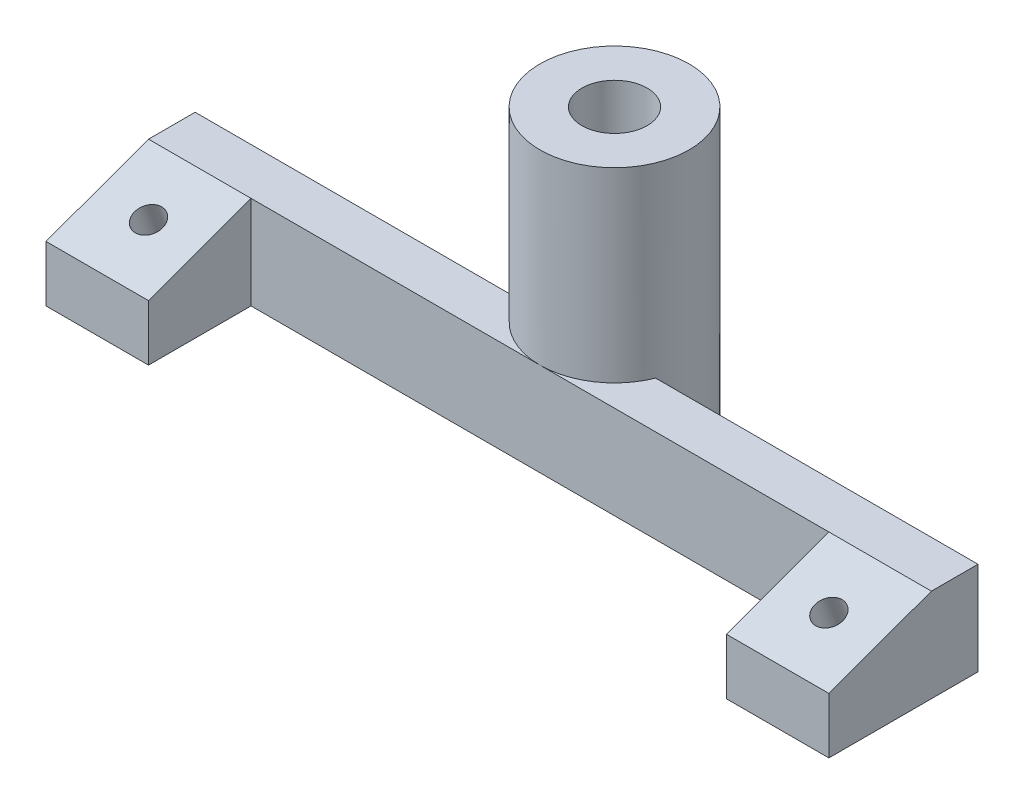
ISO-10303-21;
HEADER;
FILE_DESCRIPTION(('STEP AP214'),'2;1');
FILE_NAME('part.step','',(''),(''),'','','');
FILE_SCHEMA(('AUTOMOTIVE_DESIGN { 1 0 10303 214 1 1 1 1 }'));
ENDSEC;
DATA;
#1=APPLICATION_CONTEXT('core data for automotive mechanical design processes');
#2=APPLICATION_PROTOCOL_DEFINITION('international standard','automotive_design',2000,#1);
#3=PRODUCT_CONTEXT('',#1,'mechanical');
#4=PRODUCT('Part','Part','',(#3));
#5=PRODUCT_RELATED_PRODUCT_CATEGORY('part','',(#4));
#6=PRODUCT_DEFINITION_FORMATION('','',#4);
#7=PRODUCT_DEFINITION_CONTEXT('part definition',#1,'design');
#8=PRODUCT_DEFINITION('design','',#6,#7);
#9=PRODUCT_DEFINITION_SHAPE('','',#8);
#10=(LENGTH_UNIT() NAMED_UNIT(*) SI_UNIT(.MILLI.,.METRE.));
#11=(NAMED_UNIT(*) PLANE_ANGLE_UNIT() SI_UNIT($,.RADIAN.));
#12=(NAMED_UNIT(*) SI_UNIT($,.STERADIAN.) SOLID_ANGLE_UNIT());
#13=UNCERTAINTY_MEASURE_WITH_UNIT(LENGTH_MEASURE(1.E-05),#10,'distance_accuracy_value','');
#14=(GEOMETRIC_REPRESENTATION_CONTEXT(3) GLOBAL_UNCERTAINTY_ASSIGNED_CONTEXT((#13)) GLOBAL_UNIT_ASSIGNED_CONTEXT((#10,
#11,#12)) REPRESENTATION_CONTEXT('',''));
#15=CARTESIAN_POINT('',(0.,0.,0.));
#16=DIRECTION('',(0.,0.,1.));
#17=DIRECTION('',(1.,0.,0.));
#18=AXIS2_PLACEMENT_3D('',#15,#16,#17);
#19=CARTESIAN_POINT('',(0.,0.,-13.5));
#20=DIRECTION('',(0.,1.,0.));
#21=DIRECTION('',(0.,0.,1.));
#22=AXIS2_PLACEMENT_3D('',#19,#20,#21);
#23=CYLINDRICAL_SURFACE('',#22,3.5);
#24=CARTESIAN_POINT('',(0.,30.,-13.5));
#25=DIRECTION('',(0.,1.,0.));
#26=DIRECTION('',(0.,0.,1.));
#27=AXIS2_PLACEMENT_3D('',#24,#25,#26);
#28=CIRCLE('',#27,3.5);
#29=CARTESIAN_POINT('',(0.,30.,-10.));
#30=VERTEX_POINT('',#29);
#31=EDGE_CURVE('E145',#30,#30,#28,.T.);
#32=ORIENTED_EDGE('',*,*,#31,.T.);
#33=EDGE_LOOP('',(#32));
#34=FACE_BOUND('',#33,.T.);
#35=CARTESIAN_POINT('',(0.,24.,-13.5));
#36=DIRECTION('',(0.,-1.,0.));
#37=DIRECTION('',(0.,0.,-1.));
#38=AXIS2_PLACEMENT_3D('',#35,#36,#37);
#39=CIRCLE('',#38,3.5);
#40=CARTESIAN_POINT('',(0.,24.,-17.));
#41=VERTEX_POINT('',#40);
#42=EDGE_CURVE('E41',#41,#41,#39,.F.);
#43=ORIENTED_EDGE('',*,*,#42,.F.);
#44=EDGE_LOOP('',(#43));
#45=FACE_BOUND('',#44,.T.);
#46=ADVANCED_FACE('F37',(#34,#45),#23,.F.);
#47=CARTESIAN_POINT('',(-42.,10.,-10.5));
#48=DIRECTION('',(0.,0.,1.));
#49=DIRECTION('',(1.,0.,0.));
#50=AXIS2_PLACEMENT_3D('',#47,#48,#49);
#51=PLANE('',#50);
#52=DIRECTION('',(-1.,0.,0.));
#53=VECTOR('',#52,1.);
#54=CARTESIAN_POINT('',(-42.,10.,-10.5));
#55=LINE('',#54,#53);
#56=CARTESIAN_POINT('',(-7.41619848709566,10.,-10.5));
#57=VERTEX_POINT('',#56);
#58=CARTESIAN_POINT('',(-42.,10.,-10.5));
#59=VERTEX_POINT('',#58);
#60=EDGE_CURVE('E228',#57,#59,#55,.T.);
#61=ORIENTED_EDGE('',*,*,#60,.F.);
#62=DIRECTION('',(0.,-1.,0.));
#63=VECTOR('',#62,1.);
#64=CARTESIAN_POINT('',(-7.41619848709566,30.,-10.5));
#65=LINE('',#64,#63);
#66=CARTESIAN_POINT('',(-7.41619848709566,0.,-10.5));
#67=VERTEX_POINT('',#66);
#68=EDGE_CURVE('E54',#57,#67,#65,.T.);
#69=ORIENTED_EDGE('',*,*,#68,.T.);
#70=DIRECTION('',(-1.,0.,0.));
#71=VECTOR('',#70,1.);
#72=CARTESIAN_POINT('',(-42.,0.,-10.5));
#73=LINE('',#72,#71);
#74=CARTESIAN_POINT('',(-42.,0.,-10.5));
#75=VERTEX_POINT('',#74);
#76=EDGE_CURVE('E143',#67,#75,#73,.T.);
#77=ORIENTED_EDGE('',*,*,#76,.T.);
#78=DIRECTION('',(0.,-1.,0.));
#79=VECTOR('',#78,1.);
#80=CARTESIAN_POINT('',(-42.,10.,-10.5));
#81=LINE('',#80,#79);
#82=EDGE_CURVE('E183',#59,#75,#81,.T.);
#83=ORIENTED_EDGE('',*,*,#82,.F.);
#84=EDGE_LOOP('',(#61,#69,#77,#83));
#85=FACE_BOUND('',#84,.T.);
#86=ADVANCED_FACE('F270',(#85),#51,.F.);
#87=CARTESIAN_POINT('',(0.,10.,0.));
#88=DIRECTION('',(0.,-1.,0.));
#89=DIRECTION('',(0.,0.,-1.));
#90=AXIS2_PLACEMENT_3D('',#87,#88,#89);
#91=PLANE('',#90);
#92=CARTESIAN_POINT('',(42.,10.,-10.5));
#93=VERTEX_POINT('',#92);
#94=CARTESIAN_POINT('',(7.41619848709566,10.,-10.5));
#95=VERTEX_POINT('',#94);
#96=EDGE_CURVE('E229',#93,#95,#55,.T.);
#97=ORIENTED_EDGE('',*,*,#96,.T.);
#98=CARTESIAN_POINT('',(0.,10.,-13.5));
#99=DIRECTION('',(0.,-1.,0.));
#100=DIRECTION('',(0.,0.,-1.));
#101=AXIS2_PLACEMENT_3D('',#98,#99,#100);
#102=CIRCLE('',#101,8.);
#103=CARTESIAN_POINT('',(0.,10.,-5.5));
#104=VERTEX_POINT('',#103);
#105=EDGE_CURVE('E129',#95,#104,#102,.T.);
#106=ORIENTED_EDGE('',*,*,#105,.T.);
#107=DIRECTION('',(1.,0.,0.));
#108=VECTOR('',#107,1.);
#109=CARTESIAN_POINT('',(-31.,10.,-5.5));
#110=LINE('',#109,#108);
#111=CARTESIAN_POINT('',(31.,10.,-5.5));
#112=VERTEX_POINT('',#111);
#113=EDGE_CURVE('E234',#104,#112,#110,.T.);
#114=ORIENTED_EDGE('',*,*,#113,.T.);
#115=DIRECTION('',(-1.,0.,0.));
#116=VECTOR('',#115,1.);
#117=CARTESIAN_POINT('',(42.,10.,-5.5));
#118=LINE('',#117,#116);
#119=CARTESIAN_POINT('',(42.,10.,-5.5));
#120=VERTEX_POINT('',#119);
#121=EDGE_CURVE('E213',#120,#112,#118,.T.);
#122=ORIENTED_EDGE('',*,*,#121,.F.);
#123=DIRECTION('',(0.,0.,-1.));
#124=VECTOR('',#123,1.);
#125=CARTESIAN_POINT('',(42.,10.,-5.5));
#126=LINE('',#125,#124);
#127=EDGE_CURVE('E169',#120,#93,#126,.T.);
#128=ORIENTED_EDGE('',*,*,#127,.T.);
#129=EDGE_LOOP('',(#97,#106,#114,#122,#128));
#130=FACE_BOUND('',#129,.T.);
#131=ADVANCED_FACE('F300',(#130),#91,.F.);
#132=CARTESIAN_POINT('',(31.,10.,5.5));
#133=DIRECTION('',(0.,0.,-1.));
#134=DIRECTION('',(-1.,0.,0.));
#135=AXIS2_PLACEMENT_3D('',#132,#133,#134);
#136=PLANE('',#135);
#137=DIRECTION('',(0.,-1.,0.));
#138=VECTOR('',#137,1.);
#139=CARTESIAN_POINT('',(42.,10.,5.5));
#140=LINE('',#139,#138);
#141=CARTESIAN_POINT('',(42.,5.99632742307177,5.5));
#142=VERTEX_POINT('',#141);
#143=CARTESIAN_POINT('',(42.,0.,5.5));
#144=VERTEX_POINT('',#143);
#145=EDGE_CURVE('E46',#142,#144,#140,.T.);
#146=ORIENTED_EDGE('',*,*,#145,.F.);
#147=DIRECTION('',(-1.,0.,0.));
#148=VECTOR('',#147,1.);
#149=CARTESIAN_POINT('',(42.,5.99632742307177,5.5));
#150=LINE('',#149,#148);
#151=CARTESIAN_POINT('',(31.,5.99632742307177,5.5));
#152=VERTEX_POINT('',#151);
#153=EDGE_CURVE('E215',#142,#152,#150,.T.);
#154=ORIENTED_EDGE('',*,*,#153,.T.);
#155=DIRECTION('',(0.,-1.,0.));
#156=VECTOR('',#155,1.);
#157=CARTESIAN_POINT('',(31.,10.,5.5));
#158=LINE('',#157,#156);
#159=CARTESIAN_POINT('',(31.,0.,5.5));
#160=VERTEX_POINT('',#159);
#161=EDGE_CURVE('E170',#152,#160,#158,.T.);
#162=ORIENTED_EDGE('',*,*,#161,.T.);
#163=DIRECTION('',(1.,0.,0.));
#164=VECTOR('',#163,1.);
#165=CARTESIAN_POINT('',(31.,0.,5.5));
#166=LINE('',#165,#164);
#167=EDGE_CURVE('E226',#160,#144,#166,.T.);
#168=ORIENTED_EDGE('',*,*,#167,.T.);
#169=EDGE_LOOP('',(#146,#154,#162,#168));
#170=FACE_BOUND('',#169,.T.);
#171=ADVANCED_FACE('F39',(#170),#136,.F.);
#172=CARTESIAN_POINT('',(42.,10.,-10.5));
#173=DIRECTION('',(-1.,0.,0.));
#174=DIRECTION('',(0.,0.,1.));
#175=AXIS2_PLACEMENT_3D('',#172,#173,#174);
#176=PLANE('',#175);
#177=ORIENTED_EDGE('',*,*,#127,.F.);
#178=DIRECTION('',(0.,-0.342020143325669,0.939692620785908));
#179=VECTOR('',#178,1.);
#180=CARTESIAN_POINT('',(42.,10.,-5.5));
#181=LINE('',#180,#179);
#182=EDGE_CURVE('E62',#120,#142,#181,.T.);
#183=ORIENTED_EDGE('',*,*,#182,.T.);
#184=ORIENTED_EDGE('',*,*,#145,.T.);
#185=DIRECTION('',(0.,0.,-1.));
#186=VECTOR('',#185,1.);
#187=CARTESIAN_POINT('',(42.,0.,-10.5));
#188=LINE('',#187,#186);
#189=CARTESIAN_POINT('',(42.,0.,-10.5));
#190=VERTEX_POINT('',#189);
#191=EDGE_CURVE('E156',#144,#190,#188,.T.);
#192=ORIENTED_EDGE('',*,*,#191,.T.);
#193=DIRECTION('',(0.,-1.,0.));
#194=VECTOR('',#193,1.);
#195=CARTESIAN_POINT('',(42.,10.,-10.5));
#196=LINE('',#195,#194);
#197=EDGE_CURVE('E150',#93,#190,#196,.T.);
#198=ORIENTED_EDGE('',*,*,#197,.F.);
#199=EDGE_LOOP('',(#177,#183,#184,#192,#198));
#200=FACE_BOUND('',#199,.T.);
#201=ADVANCED_FACE('F242',(#200),#176,.F.);
#202=CARTESIAN_POINT('',(7.41619848709566,0.,-10.5));
#203=VERTEX_POINT('',#202);
#204=EDGE_CURVE('E141',#190,#203,#73,.T.);
#205=ORIENTED_EDGE('',*,*,#204,.T.);
#206=DIRECTION('',(0.,-1.,0.));
#207=VECTOR('',#206,1.);
#208=CARTESIAN_POINT('',(7.41619848709566,30.,-10.5));
#209=LINE('',#208,#207);
#210=EDGE_CURVE('E124',#203,#95,#209,.F.);
#211=ORIENTED_EDGE('',*,*,#210,.T.);
#212=ORIENTED_EDGE('',*,*,#96,.F.);
#213=ORIENTED_EDGE('',*,*,#197,.T.);
#214=EDGE_LOOP('',(#205,#211,#212,#213));
#215=FACE_BOUND('',#214,.T.);
#216=ADVANCED_FACE('F148',(#215),#51,.F.);
#217=CARTESIAN_POINT('',(-42.,10.,-5.5));
#218=DIRECTION('',(1.,0.,0.));
#219=DIRECTION('',(0.,0.,-1.));
#220=AXIS2_PLACEMENT_3D('',#217,#218,#219);
#221=PLANE('',#220);
#222=DIRECTION('',(0.,-1.,0.));
#223=VECTOR('',#222,1.);
#224=CARTESIAN_POINT('',(-42.,10.,5.5));
#225=LINE('',#224,#223);
#226=CARTESIAN_POINT('',(-42.,5.99632742307177,5.5));
#227=VERTEX_POINT('',#226);
#228=CARTESIAN_POINT('',(-42.,0.,5.5));
#229=VERTEX_POINT('',#228);
#230=EDGE_CURVE('E181',#227,#229,#225,.T.);
#231=ORIENTED_EDGE('',*,*,#230,.F.);
#232=DIRECTION('',(0.,-0.342020143325669,0.939692620785908));
#233=VECTOR('',#232,1.);
#234=CARTESIAN_POINT('',(-42.,10.,-5.5));
#235=LINE('',#234,#233);
#236=CARTESIAN_POINT('',(-42.,10.,-5.5));
#237=VERTEX_POINT('',#236);
#238=EDGE_CURVE('E208',#237,#227,#235,.T.);
#239=ORIENTED_EDGE('',*,*,#238,.F.);
#240=DIRECTION('',(0.,0.,1.));
#241=VECTOR('',#240,1.);
#242=CARTESIAN_POINT('',(-42.,10.,-5.5));
#243=LINE('',#242,#241);
#244=EDGE_CURVE('E231',#59,#237,#243,.T.);
#245=ORIENTED_EDGE('',*,*,#244,.F.);
#246=ORIENTED_EDGE('',*,*,#82,.T.);
#247=DIRECTION('',(0.,0.,1.));
#248=VECTOR('',#247,1.);
#249=CARTESIAN_POINT('',(-42.,0.,-5.5));
#250=LINE('',#249,#248);
#251=EDGE_CURVE('E151',#75,#229,#250,.T.);
#252=ORIENTED_EDGE('',*,*,#251,.T.);
#253=EDGE_LOOP('',(#231,#239,#245,#246,#252));
#254=FACE_BOUND('',#253,.T.);
#255=ADVANCED_FACE('F265',(#254),#221,.F.);
#256=CARTESIAN_POINT('',(-42.,10.,5.5));
#257=DIRECTION('',(0.,0.,-1.));
#258=DIRECTION('',(-1.,0.,0.));
#259=AXIS2_PLACEMENT_3D('',#256,#257,#258);
#260=PLANE('',#259);
#261=DIRECTION('',(0.,-1.,0.));
#262=VECTOR('',#261,1.);
#263=CARTESIAN_POINT('',(-31.,10.,5.5));
#264=LINE('',#263,#262);
#265=CARTESIAN_POINT('',(-31.,5.99632742307177,5.5));
#266=VERTEX_POINT('',#265);
#267=CARTESIAN_POINT('',(-31.,0.,5.5));
#268=VERTEX_POINT('',#267);
#269=EDGE_CURVE('E179',#266,#268,#264,.T.);
#270=ORIENTED_EDGE('',*,*,#269,.F.);
#271=EDGE_CURVE('E219',#266,#227,#150,.T.);
#272=ORIENTED_EDGE('',*,*,#271,.T.);
#273=ORIENTED_EDGE('',*,*,#230,.T.);
#274=DIRECTION('',(1.,0.,0.));
#275=VECTOR('',#274,1.);
#276=CARTESIAN_POINT('',(-42.,0.,5.5));
#277=LINE('',#276,#275);
#278=EDGE_CURVE('E154',#229,#268,#277,.T.);
#279=ORIENTED_EDGE('',*,*,#278,.T.);
#280=EDGE_LOOP('',(#270,#272,#273,#279));
#281=FACE_BOUND('',#280,.T.);
#282=ADVANCED_FACE('F260',(#281),#260,.F.);
#283=CARTESIAN_POINT('',(-31.,10.,-5.5));
#284=DIRECTION('',(-1.,0.,0.));
#285=DIRECTION('',(0.,0.,1.));
#286=AXIS2_PLACEMENT_3D('',#283,#284,#285);
#287=PLANE('',#286);
#288=DIRECTION('',(0.,-1.,0.));
#289=VECTOR('',#288,1.);
#290=CARTESIAN_POINT('',(-31.,10.,-5.5));
#291=LINE('',#290,#289);
#292=CARTESIAN_POINT('',(-31.,10.,-5.5));
#293=VERTEX_POINT('',#292);
#294=CARTESIAN_POINT('',(-31.,0.,-5.5));
#295=VERTEX_POINT('',#294);
#296=EDGE_CURVE('E176',#293,#295,#291,.T.);
#297=ORIENTED_EDGE('',*,*,#296,.F.);
#298=DIRECTION('',(0.,-0.342020143325669,0.939692620785908));
#299=VECTOR('',#298,1.);
#300=CARTESIAN_POINT('',(-31.,10.,-5.5));
#301=LINE('',#300,#299);
#302=EDGE_CURVE('E223',#293,#266,#301,.T.);
#303=ORIENTED_EDGE('',*,*,#302,.T.);
#304=ORIENTED_EDGE('',*,*,#269,.T.);
#305=DIRECTION('',(0.,0.,-1.));
#306=VECTOR('',#305,1.);
#307=CARTESIAN_POINT('',(-31.,0.,-5.5));
#308=LINE('',#307,#306);
#309=EDGE_CURVE('E162',#268,#295,#308,.T.);
#310=ORIENTED_EDGE('',*,*,#309,.T.);
#311=EDGE_LOOP('',(#297,#303,#304,#310));
#312=FACE_BOUND('',#311,.T.);
#313=ADVANCED_FACE('F256',(#312),#287,.F.);
#314=CARTESIAN_POINT('',(-31.,10.,-5.5));
#315=DIRECTION('',(0.,0.,-1.));
#316=DIRECTION('',(-1.,0.,0.));
#317=AXIS2_PLACEMENT_3D('',#314,#315,#316);
#318=PLANE('',#317);
#319=ORIENTED_EDGE('',*,*,#113,.F.);
#320=EDGE_CURVE('E173',#293,#104,#110,.T.);
#321=ORIENTED_EDGE('',*,*,#320,.F.);
#322=ORIENTED_EDGE('',*,*,#296,.T.);
#323=DIRECTION('',(1.,0.,0.));
#324=VECTOR('',#323,1.);
#325=CARTESIAN_POINT('',(-31.,0.,-5.5));
#326=LINE('',#325,#324);
#327=CARTESIAN_POINT('',(31.,0.,-5.5));
#328=VERTEX_POINT('',#327);
#329=EDGE_CURVE('E164',#295,#328,#326,.T.);
#330=ORIENTED_EDGE('',*,*,#329,.T.);
#331=DIRECTION('',(0.,-1.,0.));
#332=VECTOR('',#331,1.);
#333=CARTESIAN_POINT('',(31.,10.,-5.5));
#334=LINE('',#333,#332);
#335=EDGE_CURVE('E172',#112,#328,#334,.T.);
#336=ORIENTED_EDGE('',*,*,#335,.F.);
#337=EDGE_LOOP('',(#319,#321,#322,#330,#336));
#338=FACE_BOUND('',#337,.T.);
#339=ADVANCED_FACE('F252',(#338),#318,.F.);
#340=CARTESIAN_POINT('',(31.,10.,-5.5));
#341=DIRECTION('',(1.,0.,0.));
#342=DIRECTION('',(0.,0.,-1.));
#343=AXIS2_PLACEMENT_3D('',#340,#341,#342);
#344=PLANE('',#343);
#345=ORIENTED_EDGE('',*,*,#161,.F.);
#346=DIRECTION('',(0.,0.342020143325669,-0.939692620785908));
#347=VECTOR('',#346,1.);
#348=CARTESIAN_POINT('',(31.,10.,-5.5));
#349=LINE('',#348,#347);
#350=EDGE_CURVE('E218',#152,#112,#349,.T.);
#351=ORIENTED_EDGE('',*,*,#350,.T.);
#352=ORIENTED_EDGE('',*,*,#335,.T.);
#353=DIRECTION('',(0.,0.,1.));
#354=VECTOR('',#353,1.);
#355=CARTESIAN_POINT('',(31.,0.,-5.5));
#356=LINE('',#355,#354);
#357=EDGE_CURVE('E166',#328,#160,#356,.T.);
#358=ORIENTED_EDGE('',*,*,#357,.T.);
#359=EDGE_LOOP('',(#345,#351,#352,#358));
#360=FACE_BOUND('',#359,.T.);
#361=ADVANCED_FACE('F248',(#360),#344,.F.);
#362=ORIENTED_EDGE('',*,*,#320,.T.);
#363=EDGE_CURVE('E319',#104,#57,#102,.T.);
#364=ORIENTED_EDGE('',*,*,#363,.T.);
#365=ORIENTED_EDGE('',*,*,#60,.T.);
#366=ORIENTED_EDGE('',*,*,#244,.T.);
#367=DIRECTION('',(1.,0.,0.));
#368=VECTOR('',#367,1.);
#369=CARTESIAN_POINT('',(0.,10.,-5.5));
#370=LINE('',#369,#368);
#371=EDGE_CURVE('E11',#237,#293,#370,.T.);
#372=ORIENTED_EDGE('',*,*,#371,.T.);
#373=EDGE_LOOP('',(#362,#364,#365,#366,#372));
#374=FACE_BOUND('',#373,.T.);
#375=ADVANCED_FACE('F339',(#374),#91,.F.);
#376=CARTESIAN_POINT('',(0.,0.,0.));
#377=DIRECTION('',(0.,-1.,0.));
#378=DIRECTION('',(0.,0.,-1.));
#379=AXIS2_PLACEMENT_3D('',#376,#377,#378);
#380=PLANE('',#379);
#381=CARTESIAN_POINT('',(0.,0.,-13.5));
#382=DIRECTION('',(0.,-1.,0.));
#383=DIRECTION('',(0.,0.,-1.));
#384=AXIS2_PLACEMENT_3D('',#381,#382,#383);
#385=CIRCLE('',#384,5.25);
#386=CARTESIAN_POINT('',(0.,0.,-18.75));
#387=VERTEX_POINT('',#386);
#388=EDGE_CURVE('E323',#387,#387,#385,.T.);
#389=ORIENTED_EDGE('',*,*,#388,.F.);
#390=EDGE_LOOP('',(#389));
#391=FACE_BOUND('',#390,.T.);
#392=ORIENTED_EDGE('',*,*,#76,.F.);
#393=CARTESIAN_POINT('',(0.,0.,-13.5));
#394=DIRECTION('',(0.,-1.,0.));
#395=DIRECTION('',(0.,0.,-1.));
#396=AXIS2_PLACEMENT_3D('',#393,#394,#395);
#397=CIRCLE('',#396,8.);
#398=EDGE_CURVE('E127',#67,#203,#397,.T.);
#399=ORIENTED_EDGE('',*,*,#398,.T.);
#400=ORIENTED_EDGE('',*,*,#204,.F.);
#401=ORIENTED_EDGE('',*,*,#191,.F.);
#402=ORIENTED_EDGE('',*,*,#167,.F.);
#403=ORIENTED_EDGE('',*,*,#357,.F.);
#404=ORIENTED_EDGE('',*,*,#329,.F.);
#405=ORIENTED_EDGE('',*,*,#309,.F.);
#406=ORIENTED_EDGE('',*,*,#278,.F.);
#407=ORIENTED_EDGE('',*,*,#251,.F.);
#408=EDGE_LOOP('',(#392,#399,#400,#401,#402,#403,#404,#405,#406,#407));
#409=FACE_BOUND('',#408,.T.);
#410=CARTESIAN_POINT('',(-36.5,0.,-2.91109351978716));
#411=DIRECTION('',(0.,-1.,0.));
#412=DIRECTION('',(0.,0.,1.));
#413=AXIS2_PLACEMENT_3D('',#410,#411,#412);
#414=ELLIPSE('',#413,3.45857776054672,3.25);
#415=CARTESIAN_POINT('',(-36.5,0.,0.547484240759561));
#416=VERTEX_POINT('',#415);
#417=EDGE_CURVE('E197',#416,#416,#414,.T.);
#418=ORIENTED_EDGE('',*,*,#417,.F.);
#419=EDGE_LOOP('',(#418));
#420=FACE_BOUND('',#419,.T.);
#421=CARTESIAN_POINT('',(36.5,0.,-2.91109351978716));
#422=DIRECTION('',(0.,-1.,0.));
#423=DIRECTION('',(0.,0.,1.));
#424=AXIS2_PLACEMENT_3D('',#421,#422,#423);
#425=ELLIPSE('',#424,3.45857776054672,3.25);
#426=CARTESIAN_POINT('',(36.5,0.,0.547484240759561));
#427=VERTEX_POINT('',#426);
#428=EDGE_CURVE('E195',#427,#427,#425,.T.);
#429=ORIENTED_EDGE('',*,*,#428,.F.);
#430=EDGE_LOOP('',(#429));
#431=FACE_BOUND('',#430,.T.);
#432=ADVANCED_FACE('F138',(#391,#409,#420,#431),#380,.T.);
#433=CARTESIAN_POINT('',(42.,10.,-5.5));
#434=DIRECTION('',(0.,-0.939692620785908,-0.342020143325669));
#435=DIRECTION('',(0.,0.342020143325669,-0.939692620785908));
#436=AXIS2_PLACEMENT_3D('',#433,#434,#435);
#437=PLANE('',#436);
#438=CARTESIAN_POINT('',(36.5,7.99816371153588,0.));
#439=DIRECTION('',(0.,-0.939692620785908,-0.342020143325669));
#440=DIRECTION('',(0.,0.342020143325669,-0.939692620785908));
#441=AXIS2_PLACEMENT_3D('',#438,#439,#440);
#442=CIRCLE('',#441,1.5);
#443=CARTESIAN_POINT('',(36.5,8.51119392652439,-1.40953893117886));
#444=VERTEX_POINT('',#443);
#445=EDGE_CURVE('E199',#444,#444,#442,.T.);
#446=ORIENTED_EDGE('',*,*,#445,.T.);
#447=EDGE_LOOP('',(#446));
#448=FACE_BOUND('',#447,.T.);
#449=ORIENTED_EDGE('',*,*,#153,.F.);
#450=ORIENTED_EDGE('',*,*,#182,.F.);
#451=ORIENTED_EDGE('',*,*,#121,.T.);
#452=ORIENTED_EDGE('',*,*,#350,.F.);
#453=EDGE_LOOP('',(#449,#450,#451,#452));
#454=FACE_BOUND('',#453,.T.);
#455=ADVANCED_FACE('F338',(#448,#454),#437,.F.);
#456=CARTESIAN_POINT('',(-36.5,7.99816371153588,0.));
#457=DIRECTION('',(0.,-0.939692620785908,-0.342020143325669));
#458=DIRECTION('',(0.,0.342020143325669,-0.939692620785908));
#459=AXIS2_PLACEMENT_3D('',#456,#457,#458);
#460=CIRCLE('',#459,1.5);
#461=CARTESIAN_POINT('',(-36.5,8.51119392652439,-1.40953893117886));
#462=VERTEX_POINT('',#461);
#463=EDGE_CURVE('E203',#462,#462,#460,.T.);
#464=ORIENTED_EDGE('',*,*,#463,.T.);
#465=EDGE_LOOP('',(#464));
#466=FACE_BOUND('',#465,.T.);
#467=ORIENTED_EDGE('',*,*,#371,.F.);
#468=ORIENTED_EDGE('',*,*,#238,.T.);
#469=ORIENTED_EDGE('',*,*,#271,.F.);
#470=ORIENTED_EDGE('',*,*,#302,.F.);
#471=EDGE_LOOP('',(#467,#468,#469,#470));
#472=FACE_BOUND('',#471,.T.);
#473=ADVANCED_FACE('F345',(#466,#472),#437,.F.);
#474=CARTESIAN_POINT('',(-36.5,-2.43902752827536,-3.79882694063526));
#475=DIRECTION('',(0.,0.939692620785908,0.342020143325669));
#476=DIRECTION('',(0.,-0.342020143325669,0.939692620785908));
#477=AXIS2_PLACEMENT_3D('',#474,#475,#476);
#478=CYLINDRICAL_SURFACE('',#477,1.5);
#479=CARTESIAN_POINT('',(-36.5,4.23939322839225,-1.36808057330267));
#480=DIRECTION('',(0.,0.939692620785908,0.342020143325669));
#481=DIRECTION('',(0.,-0.342020143325669,0.939692620785908));
#482=AXIS2_PLACEMENT_3D('',#479,#480,#481);
#483=CIRCLE('',#482,1.5);
#484=CARTESIAN_POINT('',(-36.5,3.72636301340374,0.0414583578761936));
#485=VERTEX_POINT('',#484);
#486=EDGE_CURVE('E191',#485,#485,#483,.T.);
#487=ORIENTED_EDGE('',*,*,#486,.F.);
#488=EDGE_LOOP('',(#487));
#489=FACE_BOUND('',#488,.T.);
#490=ORIENTED_EDGE('',*,*,#463,.F.);
#491=EDGE_LOOP('',(#490));
#492=FACE_BOUND('',#491,.T.);
#493=ADVANCED_FACE('F415',(#489,#492),#478,.F.);
#494=CARTESIAN_POINT('',(36.5,-2.43902752827536,-3.79882694063526));
#495=DIRECTION('',(0.,0.939692620785908,0.342020143325669));
#496=DIRECTION('',(0.,-0.342020143325669,0.939692620785908));
#497=AXIS2_PLACEMENT_3D('',#494,#495,#496);
#498=CYLINDRICAL_SURFACE('',#497,1.5);
#499=CARTESIAN_POINT('',(36.5,4.23939322839225,-1.36808057330267));
#500=DIRECTION('',(0.,0.939692620785908,0.342020143325669));
#501=DIRECTION('',(0.,-0.342020143325669,0.939692620785908));
#502=AXIS2_PLACEMENT_3D('',#499,#500,#501);
#503=CIRCLE('',#502,1.5);
#504=CARTESIAN_POINT('',(36.5,3.72636301340374,0.0414583578761936));
#505=VERTEX_POINT('',#504);
#506=EDGE_CURVE('E188',#505,#505,#503,.T.);
#507=ORIENTED_EDGE('',*,*,#506,.F.);
#508=EDGE_LOOP('',(#507));
#509=FACE_BOUND('',#508,.T.);
#510=ORIENTED_EDGE('',*,*,#445,.F.);
#511=EDGE_LOOP('',(#510));
#512=FACE_BOUND('',#511,.T.);
#513=ADVANCED_FACE('F405',(#509,#512),#498,.F.);
#514=CARTESIAN_POINT('',(36.5,-2.43902752827536,-3.79882694063526));
#515=DIRECTION('',(0.,0.939692620785908,0.342020143325669));
#516=DIRECTION('',(0.,-0.342020143325669,0.939692620785908));
#517=AXIS2_PLACEMENT_3D('',#514,#515,#516);
#518=CYLINDRICAL_SURFACE('',#517,3.25);
#519=ORIENTED_EDGE('',*,*,#428,.T.);
#520=EDGE_LOOP('',(#519));
#521=FACE_BOUND('',#520,.T.);
#522=CARTESIAN_POINT('',(36.5,4.23939322839225,-1.36808057330267));
#523=DIRECTION('',(0.,0.939692620785908,0.342020143325669));
#524=DIRECTION('',(0.,-0.342020143325669,0.939692620785908));
#525=AXIS2_PLACEMENT_3D('',#522,#523,#524);
#526=CIRCLE('',#525,3.25);
#527=CARTESIAN_POINT('',(36.5,3.12782776258382,1.68592044425153));
#528=VERTEX_POINT('',#527);
#529=EDGE_CURVE('E271',#528,#528,#526,.T.);
#530=ORIENTED_EDGE('',*,*,#529,.T.);
#531=EDGE_LOOP('',(#530));
#532=FACE_BOUND('',#531,.T.);
#533=ADVANCED_FACE('F395',(#521,#532),#518,.F.);
#534=CARTESIAN_POINT('',(36.5,4.23939322839225,-1.36808057330267));
#535=DIRECTION('',(0.,0.939692620785908,0.342020143325669));
#536=DIRECTION('',(0.,-0.342020143325669,0.939692620785908));
#537=AXIS2_PLACEMENT_3D('',#534,#535,#536);
#538=PLANE('',#537);
#539=ORIENTED_EDGE('',*,*,#506,.T.);
#540=EDGE_LOOP('',(#539));
#541=FACE_BOUND('',#540,.T.);
#542=ORIENTED_EDGE('',*,*,#529,.F.);
#543=EDGE_LOOP('',(#542));
#544=FACE_BOUND('',#543,.T.);
#545=ADVANCED_FACE('F292',(#541,#544),#538,.F.);
#546=CARTESIAN_POINT('',(-36.5,-2.43902752827536,-3.79882694063526));
#547=DIRECTION('',(0.,0.939692620785908,0.342020143325669));
#548=DIRECTION('',(0.,-0.342020143325669,0.939692620785908));
#549=AXIS2_PLACEMENT_3D('',#546,#547,#548);
#550=CYLINDRICAL_SURFACE('',#549,3.25);
#551=ORIENTED_EDGE('',*,*,#417,.T.);
#552=EDGE_LOOP('',(#551));
#553=FACE_BOUND('',#552,.T.);
#554=CARTESIAN_POINT('',(-36.5,4.23939322839225,-1.36808057330267));
#555=DIRECTION('',(0.,0.939692620785908,0.342020143325669));
#556=DIRECTION('',(0.,-0.342020143325669,0.939692620785908));
#557=AXIS2_PLACEMENT_3D('',#554,#555,#556);
#558=CIRCLE('',#557,3.25);
#559=CARTESIAN_POINT('',(-36.5,3.12782776258382,1.68592044425153));
#560=VERTEX_POINT('',#559);
#561=EDGE_CURVE('E192',#560,#560,#558,.T.);
#562=ORIENTED_EDGE('',*,*,#561,.T.);
#563=EDGE_LOOP('',(#562));
#564=FACE_BOUND('',#563,.T.);
#565=ADVANCED_FACE('F279',(#553,#564),#550,.F.);
#566=CARTESIAN_POINT('',(-36.5,4.23939322839225,-1.36808057330267));
#567=DIRECTION('',(0.,0.939692620785908,0.342020143325669));
#568=DIRECTION('',(0.,-0.342020143325669,0.939692620785908));
#569=AXIS2_PLACEMENT_3D('',#566,#567,#568);
#570=PLANE('',#569);
#571=ORIENTED_EDGE('',*,*,#486,.T.);
#572=EDGE_LOOP('',(#571));
#573=FACE_BOUND('',#572,.T.);
#574=ORIENTED_EDGE('',*,*,#561,.F.);
#575=EDGE_LOOP('',(#574));
#576=FACE_BOUND('',#575,.T.);
#577=ADVANCED_FACE('F281',(#573,#576),#570,.F.);
#578=CARTESIAN_POINT('',(0.,30.,-13.5));
#579=DIRECTION('',(0.,-1.,0.));
#580=DIRECTION('',(0.,0.,-1.));
#581=AXIS2_PLACEMENT_3D('',#578,#579,#580);
#582=CYLINDRICAL_SURFACE('',#581,8.);
#583=CARTESIAN_POINT('',(0.,30.,-13.5));
#584=DIRECTION('',(0.,-1.,0.));
#585=DIRECTION('',(0.,0.,-1.));
#586=AXIS2_PLACEMENT_3D('',#583,#584,#585);
#587=CIRCLE('',#586,8.);
#588=CARTESIAN_POINT('',(0.,30.,-21.5));
#589=VERTEX_POINT('',#588);
#590=EDGE_CURVE('E144',#589,#589,#587,.T.);
#591=ORIENTED_EDGE('',*,*,#590,.T.);
#592=EDGE_LOOP('',(#591));
#593=FACE_BOUND('',#592,.T.);
#594=ORIENTED_EDGE('',*,*,#68,.F.);
#595=ORIENTED_EDGE('',*,*,#363,.F.);
#596=ORIENTED_EDGE('',*,*,#105,.F.);
#597=ORIENTED_EDGE('',*,*,#210,.F.);
#598=ORIENTED_EDGE('',*,*,#398,.F.);
#599=EDGE_LOOP('',(#594,#595,#596,#597,#598));
#600=FACE_BOUND('',#599,.T.);
#601=ADVANCED_FACE('F126',(#593,#600),#582,.T.);
#602=CARTESIAN_POINT('',(0.,30.,-13.5));
#603=DIRECTION('',(0.,-1.,0.));
#604=DIRECTION('',(0.,0.,-1.));
#605=AXIS2_PLACEMENT_3D('',#602,#603,#604);
#606=PLANE('',#605);
#607=ORIENTED_EDGE('',*,*,#31,.F.);
#608=EDGE_LOOP('',(#607));
#609=FACE_BOUND('',#608,.T.);
#610=ORIENTED_EDGE('',*,*,#590,.F.);
#611=EDGE_LOOP('',(#610));
#612=FACE_BOUND('',#611,.T.);
#613=ADVANCED_FACE('F289',(#609,#612),#606,.F.);
#614=CARTESIAN_POINT('',(0.,24.,-13.5));
#615=DIRECTION('',(0.,-1.,0.));
#616=DIRECTION('',(0.,0.,-1.));
#617=AXIS2_PLACEMENT_3D('',#614,#615,#616);
#618=PLANE('',#617);
#619=CARTESIAN_POINT('',(0.,24.,-13.5));
#620=DIRECTION('',(0.,-1.,0.));
#621=DIRECTION('',(0.,0.,-1.));
#622=AXIS2_PLACEMENT_3D('',#619,#620,#621);
#623=CIRCLE('',#622,5.25);
#624=CARTESIAN_POINT('',(0.,24.,-18.75));
#625=VERTEX_POINT('',#624);
#626=EDGE_CURVE('E326',#625,#625,#623,.T.);
#627=ORIENTED_EDGE('',*,*,#626,.T.);
#628=EDGE_LOOP('',(#627));
#629=FACE_BOUND('',#628,.T.);
#630=ORIENTED_EDGE('',*,*,#42,.T.);
#631=EDGE_LOOP('',(#630));
#632=FACE_BOUND('',#631,.T.);
#633=ADVANCED_FACE('F309',(#629,#632),#618,.T.);
#634=CARTESIAN_POINT('',(0.,24.,-13.5));
#635=DIRECTION('',(0.,-1.,0.));
#636=DIRECTION('',(0.,0.,-1.));
#637=AXIS2_PLACEMENT_3D('',#634,#635,#636);
#638=CYLINDRICAL_SURFACE('',#637,5.25);
#639=ORIENTED_EDGE('',*,*,#626,.F.);
#640=EDGE_LOOP('',(#639));
#641=FACE_BOUND('',#640,.T.);
#642=ORIENTED_EDGE('',*,*,#388,.T.);
#643=EDGE_LOOP('',(#642));
#644=FACE_BOUND('',#643,.T.);
#645=ADVANCED_FACE('F306',(#641,#644),#638,.F.);
#646=CLOSED_SHELL('',(#46,#86,#131,#171,#201,#216,#255,#282,#313,#339,#361,#375,#432,#455,#473,
#493,#513,#533,#545,#565,#577,#601,#613,#633,#645));
#647=MANIFOLD_SOLID_BREP('B2',#646);
#648=ADVANCED_BREP_SHAPE_REPRESENTATION('',(#18,#647),#14);
#649=SHAPE_DEFINITION_REPRESENTATION(#9,#648);
ENDSEC;
END-ISO-10303-21;
